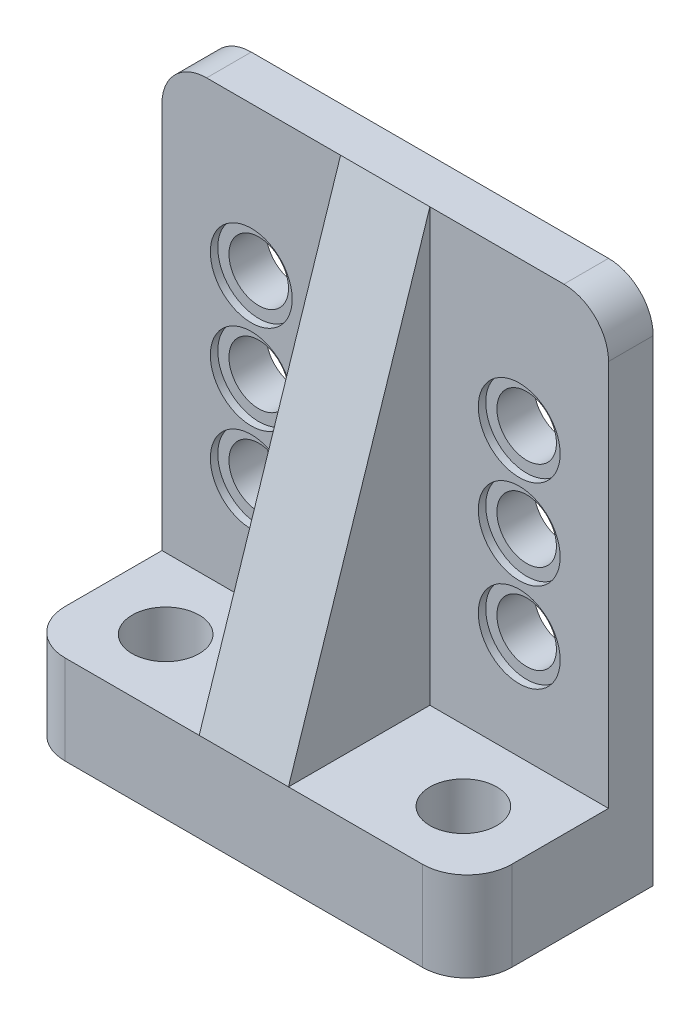
ISO-10303-21;
HEADER;
FILE_DESCRIPTION(('STEP AP214'),'2;1');
FILE_NAME('part.step','',(''),(''),'','','');
FILE_SCHEMA(('AUTOMOTIVE_DESIGN { 1 0 10303 214 1 1 1 1 }'));
ENDSEC;
DATA;
#1=APPLICATION_CONTEXT('core data for automotive mechanical design processes');
#2=APPLICATION_PROTOCOL_DEFINITION('international standard','automotive_design',2000,#1);
#3=PRODUCT_CONTEXT('',#1,'mechanical');
#4=PRODUCT('Part','Part','',(#3));
#5=PRODUCT_RELATED_PRODUCT_CATEGORY('part','',(#4));
#6=PRODUCT_DEFINITION_FORMATION('','',#4);
#7=PRODUCT_DEFINITION_CONTEXT('part definition',#1,'design');
#8=PRODUCT_DEFINITION('design','',#6,#7);
#9=PRODUCT_DEFINITION_SHAPE('','',#8);
#10=(LENGTH_UNIT() NAMED_UNIT(*) SI_UNIT(.MILLI.,.METRE.));
#11=(NAMED_UNIT(*) PLANE_ANGLE_UNIT() SI_UNIT($,.RADIAN.));
#12=(NAMED_UNIT(*) SI_UNIT($,.STERADIAN.) SOLID_ANGLE_UNIT());
#13=UNCERTAINTY_MEASURE_WITH_UNIT(LENGTH_MEASURE(1.E-05),#10,'distance_accuracy_value','');
#14=(GEOMETRIC_REPRESENTATION_CONTEXT(3) GLOBAL_UNCERTAINTY_ASSIGNED_CONTEXT((#13)) GLOBAL_UNIT_ASSIGNED_CONTEXT((#10,
#11,#12)) REPRESENTATION_CONTEXT('',''));
#15=CARTESIAN_POINT('',(0.,0.,0.));
#16=DIRECTION('',(0.,0.,1.));
#17=DIRECTION('',(1.,0.,0.));
#18=AXIS2_PLACEMENT_3D('',#15,#16,#17);
#19=CARTESIAN_POINT('',(5.99999999999999,25.,0.));
#20=DIRECTION('',(0.,0.,1.));
#21=DIRECTION('',(1.,0.,0.));
#22=AXIS2_PLACEMENT_3D('',#19,#20,#21);
#23=CYLINDRICAL_SURFACE('',#22,2.);
#24=CARTESIAN_POINT('',(5.99999999999999,25.,0.));
#25=DIRECTION('',(0.,0.,1.));
#26=DIRECTION('',(1.,0.,0.));
#27=AXIS2_PLACEMENT_3D('',#24,#25,#26);
#28=CIRCLE('',#27,2.);
#29=CARTESIAN_POINT('',(8.,25.,0.));
#30=VERTEX_POINT('',#29);
#31=EDGE_CURVE('E181',#30,#30,#28,.T.);
#32=ORIENTED_EDGE('',*,*,#31,.F.);
#33=EDGE_LOOP('',(#32));
#34=FACE_BOUND('',#33,.T.);
#35=CARTESIAN_POINT('',(5.99999999999999,25.,2.5));
#36=DIRECTION('',(0.,0.,1.));
#37=DIRECTION('',(1.,0.,0.));
#38=AXIS2_PLACEMENT_3D('',#35,#36,#37);
#39=CIRCLE('',#38,2.);
#40=CARTESIAN_POINT('',(8.,25.,2.5));
#41=VERTEX_POINT('',#40);
#42=EDGE_CURVE('E37',#41,#41,#39,.F.);
#43=ORIENTED_EDGE('',*,*,#42,.F.);
#44=EDGE_LOOP('',(#43));
#45=FACE_BOUND('',#44,.T.);
#46=ADVANCED_FACE('F33',(#34,#45),#23,.F.);
#47=CARTESIAN_POINT('',(24.,13.,0.));
#48=DIRECTION('',(0.,0.,1.));
#49=DIRECTION('',(1.,0.,0.));
#50=AXIS2_PLACEMENT_3D('',#47,#48,#49);
#51=CYLINDRICAL_SURFACE('',#50,2.);
#52=CARTESIAN_POINT('',(24.,13.,0.));
#53=DIRECTION('',(0.,0.,1.));
#54=DIRECTION('',(1.,0.,0.));
#55=AXIS2_PLACEMENT_3D('',#52,#53,#54);
#56=CIRCLE('',#55,2.);
#57=CARTESIAN_POINT('',(26.,13.,0.));
#58=VERTEX_POINT('',#57);
#59=EDGE_CURVE('E172',#58,#58,#56,.T.);
#60=ORIENTED_EDGE('',*,*,#59,.F.);
#61=EDGE_LOOP('',(#60));
#62=FACE_BOUND('',#61,.T.);
#63=CARTESIAN_POINT('',(24.,13.,2.5));
#64=DIRECTION('',(0.,0.,1.));
#65=DIRECTION('',(1.,0.,0.));
#66=AXIS2_PLACEMENT_3D('',#63,#64,#65);
#67=CIRCLE('',#66,2.);
#68=CARTESIAN_POINT('',(26.,13.,2.5));
#69=VERTEX_POINT('',#68);
#70=EDGE_CURVE('E260',#69,#69,#67,.F.);
#71=ORIENTED_EDGE('',*,*,#70,.F.);
#72=EDGE_LOOP('',(#71));
#73=FACE_BOUND('',#72,.T.);
#74=ADVANCED_FACE('F323',(#62,#73),#51,.F.);
#75=CARTESIAN_POINT('',(5.99999999999999,13.,0.));
#76=DIRECTION('',(0.,0.,1.));
#77=DIRECTION('',(1.,0.,0.));
#78=AXIS2_PLACEMENT_3D('',#75,#76,#77);
#79=CYLINDRICAL_SURFACE('',#78,2.);
#80=CARTESIAN_POINT('',(5.99999999999999,13.,0.));
#81=DIRECTION('',(0.,0.,1.));
#82=DIRECTION('',(-1.,0.,0.));
#83=AXIS2_PLACEMENT_3D('',#80,#81,#82);
#84=CIRCLE('',#83,2.);
#85=CARTESIAN_POINT('',(3.99999999999999,13.,0.));
#86=VERTEX_POINT('',#85);
#87=EDGE_CURVE('E169',#86,#86,#84,.T.);
#88=ORIENTED_EDGE('',*,*,#87,.F.);
#89=EDGE_LOOP('',(#88));
#90=FACE_BOUND('',#89,.T.);
#91=CARTESIAN_POINT('',(5.99999999999999,13.,2.5));
#92=DIRECTION('',(0.,0.,1.));
#93=DIRECTION('',(1.,0.,0.));
#94=AXIS2_PLACEMENT_3D('',#91,#92,#93);
#95=CIRCLE('',#94,2.);
#96=CARTESIAN_POINT('',(7.99999999999999,13.,2.5));
#97=VERTEX_POINT('',#96);
#98=EDGE_CURVE('E258',#97,#97,#95,.F.);
#99=ORIENTED_EDGE('',*,*,#98,.F.);
#100=EDGE_LOOP('',(#99));
#101=FACE_BOUND('',#100,.T.);
#102=ADVANCED_FACE('F329',(#90,#101),#79,.F.);
#103=CARTESIAN_POINT('',(5.99999999999999,19.,0.));
#104=DIRECTION('',(0.,0.,1.));
#105=DIRECTION('',(1.,0.,0.));
#106=AXIS2_PLACEMENT_3D('',#103,#104,#105);
#107=CYLINDRICAL_SURFACE('',#106,2.);
#108=CARTESIAN_POINT('',(5.99999999999999,19.,0.));
#109=DIRECTION('',(0.,0.,1.));
#110=DIRECTION('',(1.,0.,0.));
#111=AXIS2_PLACEMENT_3D('',#108,#109,#110);
#112=CIRCLE('',#111,2.);
#113=CARTESIAN_POINT('',(8.,19.,0.));
#114=VERTEX_POINT('',#113);
#115=EDGE_CURVE('E173',#114,#114,#112,.T.);
#116=ORIENTED_EDGE('',*,*,#115,.F.);
#117=EDGE_LOOP('',(#116));
#118=FACE_BOUND('',#117,.T.);
#119=CARTESIAN_POINT('',(5.99999999999999,19.,2.5));
#120=DIRECTION('',(0.,0.,1.));
#121=DIRECTION('',(1.,0.,0.));
#122=AXIS2_PLACEMENT_3D('',#119,#120,#121);
#123=CIRCLE('',#122,2.);
#124=CARTESIAN_POINT('',(8.,19.,2.5));
#125=VERTEX_POINT('',#124);
#126=EDGE_CURVE('E254',#125,#125,#123,.F.);
#127=ORIENTED_EDGE('',*,*,#126,.F.);
#128=EDGE_LOOP('',(#127));
#129=FACE_BOUND('',#128,.T.);
#130=ADVANCED_FACE('F526',(#118,#129),#107,.F.);
#131=CARTESIAN_POINT('',(24.,19.,0.));
#132=DIRECTION('',(0.,0.,1.));
#133=DIRECTION('',(1.,0.,0.));
#134=AXIS2_PLACEMENT_3D('',#131,#132,#133);
#135=CYLINDRICAL_SURFACE('',#134,2.);
#136=CARTESIAN_POINT('',(24.,19.,0.));
#137=DIRECTION('',(0.,0.,1.));
#138=DIRECTION('',(-1.,0.,0.));
#139=AXIS2_PLACEMENT_3D('',#136,#137,#138);
#140=CIRCLE('',#139,2.);
#141=CARTESIAN_POINT('',(22.,19.,0.));
#142=VERTEX_POINT('',#141);
#143=EDGE_CURVE('E168',#142,#142,#140,.T.);
#144=ORIENTED_EDGE('',*,*,#143,.F.);
#145=EDGE_LOOP('',(#144));
#146=FACE_BOUND('',#145,.T.);
#147=CARTESIAN_POINT('',(24.,19.,2.5));
#148=DIRECTION('',(0.,0.,1.));
#149=DIRECTION('',(1.,0.,0.));
#150=AXIS2_PLACEMENT_3D('',#147,#148,#149);
#151=CIRCLE('',#150,2.);
#152=CARTESIAN_POINT('',(26.,19.,2.5));
#153=VERTEX_POINT('',#152);
#154=EDGE_CURVE('E251',#153,#153,#151,.F.);
#155=ORIENTED_EDGE('',*,*,#154,.F.);
#156=EDGE_LOOP('',(#155));
#157=FACE_BOUND('',#156,.T.);
#158=ADVANCED_FACE('F535',(#146,#157),#135,.F.);
#159=CARTESIAN_POINT('',(24.,25.,0.));
#160=DIRECTION('',(0.,0.,1.));
#161=DIRECTION('',(1.,0.,0.));
#162=AXIS2_PLACEMENT_3D('',#159,#160,#161);
#163=CYLINDRICAL_SURFACE('',#162,2.);
#164=CARTESIAN_POINT('',(24.,25.,0.));
#165=DIRECTION('',(0.,0.,1.));
#166=DIRECTION('',(-1.,0.,0.));
#167=AXIS2_PLACEMENT_3D('',#164,#165,#166);
#168=CIRCLE('',#167,2.);
#169=CARTESIAN_POINT('',(22.,25.,0.));
#170=VERTEX_POINT('',#169);
#171=EDGE_CURVE('E178',#170,#170,#168,.T.);
#172=ORIENTED_EDGE('',*,*,#171,.F.);
#173=EDGE_LOOP('',(#172));
#174=FACE_BOUND('',#173,.T.);
#175=CARTESIAN_POINT('',(24.,25.,2.5));
#176=DIRECTION('',(0.,0.,1.));
#177=DIRECTION('',(1.,0.,0.));
#178=AXIS2_PLACEMENT_3D('',#175,#176,#177);
#179=CIRCLE('',#178,2.);
#180=CARTESIAN_POINT('',(26.,25.,2.5));
#181=VERTEX_POINT('',#180);
#182=EDGE_CURVE('E246',#181,#181,#179,.F.);
#183=ORIENTED_EDGE('',*,*,#182,.F.);
#184=EDGE_LOOP('',(#183));
#185=FACE_BOUND('',#184,.T.);
#186=ADVANCED_FACE('F545',(#174,#185),#163,.F.);
#187=CARTESIAN_POINT('',(0.,0.,3.));
#188=DIRECTION('',(0.,0.,-1.));
#189=DIRECTION('',(-1.,0.,0.));
#190=AXIS2_PLACEMENT_3D('',#187,#188,#189);
#191=PLANE('',#190);
#192=CARTESIAN_POINT('',(5.99999999999999,13.,3.));
#193=DIRECTION('',(0.,0.,1.));
#194=DIRECTION('',(1.,0.,0.));
#195=AXIS2_PLACEMENT_3D('',#192,#193,#194);
#196=CIRCLE('',#195,2.75);
#197=CARTESIAN_POINT('',(8.74999999999999,13.,3.));
#198=VERTEX_POINT('',#197);
#199=EDGE_CURVE('E700',#198,#198,#196,.T.);
#200=ORIENTED_EDGE('',*,*,#199,.F.);
#201=EDGE_LOOP('',(#200));
#202=FACE_BOUND('',#201,.T.);
#203=CARTESIAN_POINT('',(5.99999999999999,19.,3.));
#204=DIRECTION('',(0.,0.,1.));
#205=DIRECTION('',(1.,0.,0.));
#206=AXIS2_PLACEMENT_3D('',#203,#204,#205);
#207=CIRCLE('',#206,2.75);
#208=CARTESIAN_POINT('',(8.74999999999999,19.,3.));
#209=VERTEX_POINT('',#208);
#210=EDGE_CURVE('E692',#209,#209,#207,.T.);
#211=ORIENTED_EDGE('',*,*,#210,.F.);
#212=EDGE_LOOP('',(#211));
#213=FACE_BOUND('',#212,.T.);
#214=CARTESIAN_POINT('',(5.99999999999999,25.,3.));
#215=DIRECTION('',(0.,0.,1.));
#216=DIRECTION('',(1.,0.,0.));
#217=AXIS2_PLACEMENT_3D('',#214,#215,#216);
#218=CIRCLE('',#217,2.75);
#219=CARTESIAN_POINT('',(8.74999999999999,25.,3.));
#220=VERTEX_POINT('',#219);
#221=EDGE_CURVE('E690',#220,#220,#218,.T.);
#222=ORIENTED_EDGE('',*,*,#221,.F.);
#223=EDGE_LOOP('',(#222));
#224=FACE_BOUND('',#223,.T.);
#225=DIRECTION('',(-1.,0.,0.));
#226=VECTOR('',#225,1.);
#227=CARTESIAN_POINT('',(0.,35.,3.));
#228=LINE('',#227,#226);
#229=CARTESIAN_POINT('',(12.,35.,3.));
#230=VERTEX_POINT('',#229);
#231=CARTESIAN_POINT('',(3.,35.,3.));
#232=VERTEX_POINT('',#231);
#233=EDGE_CURVE('E192',#230,#232,#228,.T.);
#234=ORIENTED_EDGE('',*,*,#233,.T.);
#235=CARTESIAN_POINT('',(3.,32.,3.));
#236=DIRECTION('',(0.,0.,-1.));
#237=DIRECTION('',(-1.,0.,0.));
#238=AXIS2_PLACEMENT_3D('',#235,#236,#237);
#239=CIRCLE('',#238,3.);
#240=CARTESIAN_POINT('',(0.,32.,3.));
#241=VERTEX_POINT('',#240);
#242=EDGE_CURVE('E11',#232,#241,#239,.F.);
#243=ORIENTED_EDGE('',*,*,#242,.T.);
#244=DIRECTION('',(0.,-1.,0.));
#245=VECTOR('',#244,1.);
#246=CARTESIAN_POINT('',(0.,0.,3.));
#247=LINE('',#246,#245);
#248=CARTESIAN_POINT('',(0.,6.,3.));
#249=VERTEX_POINT('',#248);
#250=EDGE_CURVE('E187',#241,#249,#247,.T.);
#251=ORIENTED_EDGE('',*,*,#250,.T.);
#252=DIRECTION('',(-1.,0.,0.));
#253=VECTOR('',#252,1.);
#254=CARTESIAN_POINT('',(0.,6.,3.));
#255=LINE('',#254,#253);
#256=CARTESIAN_POINT('',(12.,6.,3.));
#257=VERTEX_POINT('',#256);
#258=EDGE_CURVE('E154',#257,#249,#255,.T.);
#259=ORIENTED_EDGE('',*,*,#258,.F.);
#260=DIRECTION('',(0.,1.,0.));
#261=VECTOR('',#260,1.);
#262=CARTESIAN_POINT('',(12.,35.,3.));
#263=LINE('',#262,#261);
#264=EDGE_CURVE('E280',#257,#230,#263,.T.);
#265=ORIENTED_EDGE('',*,*,#264,.T.);
#266=EDGE_LOOP('',(#234,#243,#251,#259,#265));
#267=FACE_BOUND('',#266,.T.);
#268=ADVANCED_FACE('F320',(#202,#213,#224,#267),#191,.F.);
#269=CARTESIAN_POINT('',(0.,6.,12.5));
#270=DIRECTION('',(0.,-1.,0.));
#271=DIRECTION('',(0.,0.,-1.));
#272=AXIS2_PLACEMENT_3D('',#269,#270,#271);
#273=PLANE('',#272);
#274=CARTESIAN_POINT('',(5.,6.,7.75));
#275=DIRECTION('',(0.,-1.,0.));
#276=DIRECTION('',(0.,0.,-1.));
#277=AXIS2_PLACEMENT_3D('',#274,#275,#276);
#278=CIRCLE('',#277,2.25);
#279=CARTESIAN_POINT('',(5.,6.,5.50000000000001));
#280=VERTEX_POINT('',#279);
#281=EDGE_CURVE('E211',#280,#280,#278,.T.);
#282=ORIENTED_EDGE('',*,*,#281,.T.);
#283=EDGE_LOOP('',(#282));
#284=FACE_BOUND('',#283,.T.);
#285=DIRECTION('',(0.,0.,-1.));
#286=VECTOR('',#285,1.);
#287=CARTESIAN_POINT('',(0.,6.,12.5));
#288=LINE('',#287,#286);
#289=CARTESIAN_POINT('',(0.,6.,9.5));
#290=VERTEX_POINT('',#289);
#291=EDGE_CURVE('E164',#290,#249,#288,.T.);
#292=ORIENTED_EDGE('',*,*,#291,.F.);
#293=CARTESIAN_POINT('',(3.,6.,9.5));
#294=DIRECTION('',(0.,-1.,0.));
#295=DIRECTION('',(0.,0.,-1.));
#296=AXIS2_PLACEMENT_3D('',#293,#294,#295);
#297=CIRCLE('',#296,3.);
#298=CARTESIAN_POINT('',(3.,6.,12.5));
#299=VERTEX_POINT('',#298);
#300=EDGE_CURVE('E229',#290,#299,#297,.F.);
#301=ORIENTED_EDGE('',*,*,#300,.T.);
#302=DIRECTION('',(-1.,0.,0.));
#303=VECTOR('',#302,1.);
#304=CARTESIAN_POINT('',(0.,6.,12.5));
#305=LINE('',#304,#303);
#306=CARTESIAN_POINT('',(12.,6.,12.5));
#307=VERTEX_POINT('',#306);
#308=EDGE_CURVE('E157',#307,#299,#305,.T.);
#309=ORIENTED_EDGE('',*,*,#308,.F.);
#310=DIRECTION('',(0.,0.,-1.));
#311=VECTOR('',#310,1.);
#312=CARTESIAN_POINT('',(12.,6.,3.));
#313=LINE('',#312,#311);
#314=EDGE_CURVE('E249',#307,#257,#313,.T.);
#315=ORIENTED_EDGE('',*,*,#314,.T.);
#316=ORIENTED_EDGE('',*,*,#258,.T.);
#317=EDGE_LOOP('',(#292,#301,#309,#315,#316));
#318=FACE_BOUND('',#317,.T.);
#319=ADVANCED_FACE('F308',(#284,#318),#273,.F.);
#320=CARTESIAN_POINT('',(24.,19.,3.));
#321=DIRECTION('',(0.,0.,1.));
#322=DIRECTION('',(1.,0.,0.));
#323=AXIS2_PLACEMENT_3D('',#320,#321,#322);
#324=CIRCLE('',#323,2.75);
#325=CARTESIAN_POINT('',(26.75,19.,3.));
#326=VERTEX_POINT('',#325);
#327=EDGE_CURVE('E712',#326,#326,#324,.T.);
#328=ORIENTED_EDGE('',*,*,#327,.F.);
#329=EDGE_LOOP('',(#328));
#330=FACE_BOUND('',#329,.T.);
#331=CARTESIAN_POINT('',(24.,13.,3.));
#332=DIRECTION('',(0.,0.,1.));
#333=DIRECTION('',(1.,0.,0.));
#334=AXIS2_PLACEMENT_3D('',#331,#332,#333);
#335=CIRCLE('',#334,2.75);
#336=CARTESIAN_POINT('',(26.75,13.,3.));
#337=VERTEX_POINT('',#336);
#338=EDGE_CURVE('E706',#337,#337,#335,.T.);
#339=ORIENTED_EDGE('',*,*,#338,.F.);
#340=EDGE_LOOP('',(#339));
#341=FACE_BOUND('',#340,.T.);
#342=CARTESIAN_POINT('',(24.,25.,3.));
#343=DIRECTION('',(0.,0.,1.));
#344=DIRECTION('',(1.,0.,0.));
#345=AXIS2_PLACEMENT_3D('',#342,#343,#344);
#346=CIRCLE('',#345,2.75);
#347=CARTESIAN_POINT('',(26.75,25.,3.));
#348=VERTEX_POINT('',#347);
#349=EDGE_CURVE('E265',#348,#348,#346,.T.);
#350=ORIENTED_EDGE('',*,*,#349,.F.);
#351=EDGE_LOOP('',(#350));
#352=FACE_BOUND('',#351,.T.);
#353=DIRECTION('',(0.,1.,0.));
#354=VECTOR('',#353,1.);
#355=CARTESIAN_POINT('',(30.,0.,3.));
#356=LINE('',#355,#354);
#357=CARTESIAN_POINT('',(30.,6.,3.));
#358=VERTEX_POINT('',#357);
#359=CARTESIAN_POINT('',(30.,32.,3.));
#360=VERTEX_POINT('',#359);
#361=EDGE_CURVE('E189',#358,#360,#356,.T.);
#362=ORIENTED_EDGE('',*,*,#361,.T.);
#363=CARTESIAN_POINT('',(27.,32.,3.));
#364=DIRECTION('',(0.,0.,-1.));
#365=DIRECTION('',(-1.,0.,0.));
#366=AXIS2_PLACEMENT_3D('',#363,#364,#365);
#367=CIRCLE('',#366,3.);
#368=CARTESIAN_POINT('',(27.,35.,3.));
#369=VERTEX_POINT('',#368);
#370=EDGE_CURVE('E42',#360,#369,#367,.F.);
#371=ORIENTED_EDGE('',*,*,#370,.T.);
#372=CARTESIAN_POINT('',(18.,35.,3.));
#373=VERTEX_POINT('',#372);
#374=EDGE_CURVE('E148',#369,#373,#228,.T.);
#375=ORIENTED_EDGE('',*,*,#374,.T.);
#376=DIRECTION('',(0.,1.,0.));
#377=VECTOR('',#376,1.);
#378=CARTESIAN_POINT('',(18.,35.,3.));
#379=LINE('',#378,#377);
#380=CARTESIAN_POINT('',(18.,6.,3.));
#381=VERTEX_POINT('',#380);
#382=EDGE_CURVE('E135',#381,#373,#379,.T.);
#383=ORIENTED_EDGE('',*,*,#382,.F.);
#384=EDGE_CURVE('E146',#358,#381,#255,.T.);
#385=ORIENTED_EDGE('',*,*,#384,.F.);
#386=EDGE_LOOP('',(#362,#371,#375,#383,#385));
#387=FACE_BOUND('',#386,.T.);
#388=ADVANCED_FACE('F145',(#330,#341,#352,#387),#191,.F.);
#389=CARTESIAN_POINT('',(0.,0.,3.));
#390=DIRECTION('',(1.,0.,0.));
#391=DIRECTION('',(0.,0.,-1.));
#392=AXIS2_PLACEMENT_3D('',#389,#390,#391);
#393=PLANE('',#392);
#394=DIRECTION('',(0.,0.,-1.));
#395=VECTOR('',#394,1.);
#396=CARTESIAN_POINT('',(0.,0.,3.));
#397=LINE('',#396,#395);
#398=CARTESIAN_POINT('',(0.,0.,9.5));
#399=VERTEX_POINT('',#398);
#400=CARTESIAN_POINT('',(0.,0.,0.));
#401=VERTEX_POINT('',#400);
#402=EDGE_CURVE('E204',#399,#401,#397,.T.);
#403=ORIENTED_EDGE('',*,*,#402,.F.);
#404=DIRECTION('',(0.,-1.,0.));
#405=VECTOR('',#404,1.);
#406=CARTESIAN_POINT('',(0.,0.,9.5));
#407=LINE('',#406,#405);
#408=EDGE_CURVE('E227',#399,#290,#407,.F.);
#409=ORIENTED_EDGE('',*,*,#408,.T.);
#410=ORIENTED_EDGE('',*,*,#291,.T.);
#411=ORIENTED_EDGE('',*,*,#250,.F.);
#412=DIRECTION('',(0.,0.,-1.));
#413=VECTOR('',#412,1.);
#414=CARTESIAN_POINT('',(0.,32.,3.));
#415=LINE('',#414,#413);
#416=CARTESIAN_POINT('',(0.,32.,0.));
#417=VERTEX_POINT('',#416);
#418=EDGE_CURVE('E224',#241,#417,#415,.T.);
#419=ORIENTED_EDGE('',*,*,#418,.T.);
#420=DIRECTION('',(0.,-1.,0.));
#421=VECTOR('',#420,1.);
#422=CARTESIAN_POINT('',(0.,0.,0.));
#423=LINE('',#422,#421);
#424=EDGE_CURVE('E186',#417,#401,#423,.T.);
#425=ORIENTED_EDGE('',*,*,#424,.T.);
#426=EDGE_LOOP('',(#403,#409,#410,#411,#419,#425));
#427=FACE_BOUND('',#426,.T.);
#428=ADVANCED_FACE('F337',(#427),#393,.F.);
#429=CARTESIAN_POINT('',(0.,0.,3.));
#430=DIRECTION('',(0.,1.,0.));
#431=DIRECTION('',(0.,0.,1.));
#432=AXIS2_PLACEMENT_3D('',#429,#430,#431);
#433=PLANE('',#432);
#434=CARTESIAN_POINT('',(5.,0.,7.75));
#435=DIRECTION('',(0.,1.,0.));
#436=DIRECTION('',(0.,0.,-1.));
#437=AXIS2_PLACEMENT_3D('',#434,#435,#436);
#438=CIRCLE('',#437,2.25);
#439=CARTESIAN_POINT('',(5.,0.,5.50000000000001));
#440=VERTEX_POINT('',#439);
#441=EDGE_CURVE('E214',#440,#440,#438,.T.);
#442=ORIENTED_EDGE('',*,*,#441,.T.);
#443=EDGE_LOOP('',(#442));
#444=FACE_BOUND('',#443,.T.);
#445=CARTESIAN_POINT('',(25.,0.,7.75));
#446=DIRECTION('',(0.,1.,0.));
#447=DIRECTION('',(0.,0.,1.));
#448=AXIS2_PLACEMENT_3D('',#445,#446,#447);
#449=CIRCLE('',#448,2.25);
#450=CARTESIAN_POINT('',(25.,0.,10.));
#451=VERTEX_POINT('',#450);
#452=EDGE_CURVE('E210',#451,#451,#449,.T.);
#453=ORIENTED_EDGE('',*,*,#452,.T.);
#454=EDGE_LOOP('',(#453));
#455=FACE_BOUND('',#454,.T.);
#456=DIRECTION('',(1.,0.,0.));
#457=VECTOR('',#456,1.);
#458=CARTESIAN_POINT('',(0.,0.,12.5));
#459=LINE('',#458,#457);
#460=CARTESIAN_POINT('',(3.,0.,12.5));
#461=VERTEX_POINT('',#460);
#462=CARTESIAN_POINT('',(27.,0.,12.5));
#463=VERTEX_POINT('',#462);
#464=EDGE_CURVE('E153',#461,#463,#459,.T.);
#465=ORIENTED_EDGE('',*,*,#464,.F.);
#466=CARTESIAN_POINT('',(3.,0.,9.5));
#467=DIRECTION('',(0.,1.,0.));
#468=DIRECTION('',(0.,0.,1.));
#469=AXIS2_PLACEMENT_3D('',#466,#467,#468);
#470=CIRCLE('',#469,3.);
#471=EDGE_CURVE('E222',#461,#399,#470,.F.);
#472=ORIENTED_EDGE('',*,*,#471,.T.);
#473=ORIENTED_EDGE('',*,*,#402,.T.);
#474=DIRECTION('',(1.,0.,0.));
#475=VECTOR('',#474,1.);
#476=CARTESIAN_POINT('',(0.,0.,0.));
#477=LINE('',#476,#475);
#478=CARTESIAN_POINT('',(30.,0.,0.));
#479=VERTEX_POINT('',#478);
#480=EDGE_CURVE('E196',#401,#479,#477,.T.);
#481=ORIENTED_EDGE('',*,*,#480,.T.);
#482=DIRECTION('',(0.,0.,-1.));
#483=VECTOR('',#482,1.);
#484=CARTESIAN_POINT('',(30.,0.,3.));
#485=LINE('',#484,#483);
#486=CARTESIAN_POINT('',(30.,0.,9.5));
#487=VERTEX_POINT('',#486);
#488=EDGE_CURVE('E194',#487,#479,#485,.T.);
#489=ORIENTED_EDGE('',*,*,#488,.F.);
#490=CARTESIAN_POINT('',(27.,0.,9.5));
#491=DIRECTION('',(0.,1.,0.));
#492=DIRECTION('',(0.,0.,1.));
#493=AXIS2_PLACEMENT_3D('',#490,#491,#492);
#494=CIRCLE('',#493,3.);
#495=EDGE_CURVE('E220',#487,#463,#494,.F.);
#496=ORIENTED_EDGE('',*,*,#495,.T.);
#497=EDGE_LOOP('',(#465,#472,#473,#481,#489,#496));
#498=FACE_BOUND('',#497,.T.);
#499=ADVANCED_FACE('F294',(#444,#455,#498),#433,.F.);
#500=CARTESIAN_POINT('',(30.,0.,3.));
#501=DIRECTION('',(-1.,0.,0.));
#502=DIRECTION('',(0.,0.,1.));
#503=AXIS2_PLACEMENT_3D('',#500,#501,#502);
#504=PLANE('',#503);
#505=DIRECTION('',(0.,0.,-1.));
#506=VECTOR('',#505,1.);
#507=CARTESIAN_POINT('',(30.,6.,12.5));
#508=LINE('',#507,#506);
#509=CARTESIAN_POINT('',(30.,6.,9.5));
#510=VERTEX_POINT('',#509);
#511=EDGE_CURVE('E152',#510,#358,#508,.T.);
#512=ORIENTED_EDGE('',*,*,#511,.F.);
#513=DIRECTION('',(0.,1.,0.));
#514=VECTOR('',#513,1.);
#515=CARTESIAN_POINT('',(30.,0.,9.5));
#516=LINE('',#515,#514);
#517=EDGE_CURVE('E235',#510,#487,#516,.F.);
#518=ORIENTED_EDGE('',*,*,#517,.T.);
#519=ORIENTED_EDGE('',*,*,#488,.T.);
#520=DIRECTION('',(0.,1.,0.));
#521=VECTOR('',#520,1.);
#522=CARTESIAN_POINT('',(30.,0.,0.));
#523=LINE('',#522,#521);
#524=CARTESIAN_POINT('',(30.,32.,0.));
#525=VERTEX_POINT('',#524);
#526=EDGE_CURVE('E199',#479,#525,#523,.T.);
#527=ORIENTED_EDGE('',*,*,#526,.T.);
#528=DIRECTION('',(0.,0.,-1.));
#529=VECTOR('',#528,1.);
#530=CARTESIAN_POINT('',(30.,32.,3.));
#531=LINE('',#530,#529);
#532=EDGE_CURVE('E233',#525,#360,#531,.F.);
#533=ORIENTED_EDGE('',*,*,#532,.T.);
#534=ORIENTED_EDGE('',*,*,#361,.F.);
#535=EDGE_LOOP('',(#512,#518,#519,#527,#533,#534));
#536=FACE_BOUND('',#535,.T.);
#537=ADVANCED_FACE('F342',(#536),#504,.F.);
#538=CARTESIAN_POINT('',(0.,35.,3.));
#539=DIRECTION('',(0.,-1.,0.));
#540=DIRECTION('',(0.,0.,-1.));
#541=AXIS2_PLACEMENT_3D('',#538,#539,#540);
#542=PLANE('',#541);
#543=ORIENTED_EDGE('',*,*,#374,.F.);
#544=DIRECTION('',(0.,0.,-1.));
#545=VECTOR('',#544,1.);
#546=CARTESIAN_POINT('',(27.,35.,3.));
#547=LINE('',#546,#545);
#548=CARTESIAN_POINT('',(27.,35.,0.));
#549=VERTEX_POINT('',#548);
#550=EDGE_CURVE('E238',#369,#549,#547,.T.);
#551=ORIENTED_EDGE('',*,*,#550,.T.);
#552=DIRECTION('',(-1.,0.,0.));
#553=VECTOR('',#552,1.);
#554=CARTESIAN_POINT('',(0.,35.,0.));
#555=LINE('',#554,#553);
#556=CARTESIAN_POINT('',(3.,35.,0.));
#557=VERTEX_POINT('',#556);
#558=EDGE_CURVE('E190',#549,#557,#555,.T.);
#559=ORIENTED_EDGE('',*,*,#558,.T.);
#560=DIRECTION('',(0.,0.,-1.));
#561=VECTOR('',#560,1.);
#562=CARTESIAN_POINT('',(3.,35.,3.));
#563=LINE('',#562,#561);
#564=EDGE_CURVE('E57',#557,#232,#563,.F.);
#565=ORIENTED_EDGE('',*,*,#564,.T.);
#566=ORIENTED_EDGE('',*,*,#233,.F.);
#567=DIRECTION('',(-1.,0.,0.));
#568=VECTOR('',#567,1.);
#569=CARTESIAN_POINT('',(18.,35.,3.));
#570=LINE('',#569,#568);
#571=EDGE_CURVE('E287',#373,#230,#570,.T.);
#572=ORIENTED_EDGE('',*,*,#571,.F.);
#573=EDGE_LOOP('',(#543,#551,#559,#565,#566,#572));
#574=FACE_BOUND('',#573,.T.);
#575=ADVANCED_FACE('F315',(#574),#542,.F.);
#576=CARTESIAN_POINT('',(0.,0.,0.));
#577=DIRECTION('',(0.,0.,-1.));
#578=DIRECTION('',(-1.,0.,0.));
#579=AXIS2_PLACEMENT_3D('',#576,#577,#578);
#580=PLANE('',#579);
#581=ORIENTED_EDGE('',*,*,#143,.T.);
#582=EDGE_LOOP('',(#581));
#583=FACE_BOUND('',#582,.T.);
#584=ORIENTED_EDGE('',*,*,#115,.T.);
#585=EDGE_LOOP('',(#584));
#586=FACE_BOUND('',#585,.T.);
#587=ORIENTED_EDGE('',*,*,#87,.T.);
#588=EDGE_LOOP('',(#587));
#589=FACE_BOUND('',#588,.T.);
#590=ORIENTED_EDGE('',*,*,#59,.T.);
#591=EDGE_LOOP('',(#590));
#592=FACE_BOUND('',#591,.T.);
#593=ORIENTED_EDGE('',*,*,#171,.T.);
#594=EDGE_LOOP('',(#593));
#595=FACE_BOUND('',#594,.T.);
#596=ORIENTED_EDGE('',*,*,#31,.T.);
#597=EDGE_LOOP('',(#596));
#598=FACE_BOUND('',#597,.T.);
#599=ORIENTED_EDGE('',*,*,#558,.F.);
#600=CARTESIAN_POINT('',(27.,32.,0.));
#601=DIRECTION('',(0.,0.,-1.));
#602=DIRECTION('',(-1.,0.,0.));
#603=AXIS2_PLACEMENT_3D('',#600,#601,#602);
#604=CIRCLE('',#603,3.);
#605=EDGE_CURVE('E243',#549,#525,#604,.T.);
#606=ORIENTED_EDGE('',*,*,#605,.T.);
#607=ORIENTED_EDGE('',*,*,#526,.F.);
#608=ORIENTED_EDGE('',*,*,#480,.F.);
#609=ORIENTED_EDGE('',*,*,#424,.F.);
#610=CARTESIAN_POINT('',(3.,32.,0.));
#611=DIRECTION('',(0.,0.,-1.));
#612=DIRECTION('',(-1.,0.,0.));
#613=AXIS2_PLACEMENT_3D('',#610,#611,#612);
#614=CIRCLE('',#613,3.);
#615=EDGE_CURVE('E241',#417,#557,#614,.T.);
#616=ORIENTED_EDGE('',*,*,#615,.T.);
#617=EDGE_LOOP('',(#599,#606,#607,#608,#609,#616));
#618=FACE_BOUND('',#617,.T.);
#619=ADVANCED_FACE('F306',(#583,#586,#589,#592,#595,#598,#618),#580,.T.);
#620=CARTESIAN_POINT('',(25.,6.,7.75));
#621=DIRECTION('',(0.,-1.,0.));
#622=DIRECTION('',(0.,0.,-1.));
#623=AXIS2_PLACEMENT_3D('',#620,#621,#622);
#624=CIRCLE('',#623,2.25);
#625=CARTESIAN_POINT('',(25.,6.,5.5));
#626=VERTEX_POINT('',#625);
#627=EDGE_CURVE('E160',#626,#626,#624,.T.);
#628=ORIENTED_EDGE('',*,*,#627,.T.);
#629=EDGE_LOOP('',(#628));
#630=FACE_BOUND('',#629,.T.);
#631=CARTESIAN_POINT('',(27.,6.,12.5));
#632=VERTEX_POINT('',#631);
#633=CARTESIAN_POINT('',(18.,6.,12.5));
#634=VERTEX_POINT('',#633);
#635=EDGE_CURVE('E163',#632,#634,#305,.T.);
#636=ORIENTED_EDGE('',*,*,#635,.F.);
#637=CARTESIAN_POINT('',(27.,6.,9.5));
#638=DIRECTION('',(0.,-1.,0.));
#639=DIRECTION('',(0.,0.,-1.));
#640=AXIS2_PLACEMENT_3D('',#637,#638,#639);
#641=CIRCLE('',#640,3.);
#642=EDGE_CURVE('E231',#632,#510,#641,.F.);
#643=ORIENTED_EDGE('',*,*,#642,.T.);
#644=ORIENTED_EDGE('',*,*,#511,.T.);
#645=ORIENTED_EDGE('',*,*,#384,.T.);
#646=DIRECTION('',(0.,0.,-1.));
#647=VECTOR('',#646,1.);
#648=CARTESIAN_POINT('',(18.,6.,3.));
#649=LINE('',#648,#647);
#650=EDGE_CURVE('E132',#634,#381,#649,.T.);
#651=ORIENTED_EDGE('',*,*,#650,.F.);
#652=EDGE_LOOP('',(#636,#643,#644,#645,#651));
#653=FACE_BOUND('',#652,.T.);
#654=ADVANCED_FACE('F150',(#630,#653),#273,.F.);
#655=CARTESIAN_POINT('',(0.,0.,12.5));
#656=DIRECTION('',(0.,0.,-1.));
#657=DIRECTION('',(-1.,0.,0.));
#658=AXIS2_PLACEMENT_3D('',#655,#656,#657);
#659=PLANE('',#658);
#660=ORIENTED_EDGE('',*,*,#308,.T.);
#661=DIRECTION('',(0.,-1.,0.));
#662=VECTOR('',#661,1.);
#663=CARTESIAN_POINT('',(3.,0.,12.5));
#664=LINE('',#663,#662);
#665=EDGE_CURVE('E217',#299,#461,#664,.T.);
#666=ORIENTED_EDGE('',*,*,#665,.T.);
#667=ORIENTED_EDGE('',*,*,#464,.T.);
#668=DIRECTION('',(0.,1.,0.));
#669=VECTOR('',#668,1.);
#670=CARTESIAN_POINT('',(27.,0.,12.5));
#671=LINE('',#670,#669);
#672=EDGE_CURVE('E207',#463,#632,#671,.T.);
#673=ORIENTED_EDGE('',*,*,#672,.T.);
#674=ORIENTED_EDGE('',*,*,#635,.T.);
#675=DIRECTION('',(-1.,0.,0.));
#676=VECTOR('',#675,1.);
#677=CARTESIAN_POINT('',(18.,6.,12.5));
#678=LINE('',#677,#676);
#679=EDGE_CURVE('E277',#634,#307,#678,.T.);
#680=ORIENTED_EDGE('',*,*,#679,.T.);
#681=EDGE_LOOP('',(#660,#666,#667,#673,#674,#680));
#682=FACE_BOUND('',#681,.T.);
#683=ADVANCED_FACE('F301',(#682),#659,.F.);
#684=CARTESIAN_POINT('',(25.,0.,7.75));
#685=DIRECTION('',(0.,1.,0.));
#686=DIRECTION('',(0.,0.,1.));
#687=AXIS2_PLACEMENT_3D('',#684,#685,#686);
#688=CYLINDRICAL_SURFACE('',#687,2.25);
#689=ORIENTED_EDGE('',*,*,#452,.F.);
#690=EDGE_LOOP('',(#689));
#691=FACE_BOUND('',#690,.T.);
#692=ORIENTED_EDGE('',*,*,#627,.F.);
#693=EDGE_LOOP('',(#692));
#694=FACE_BOUND('',#693,.T.);
#695=ADVANCED_FACE('F297',(#691,#694),#688,.F.);
#696=CARTESIAN_POINT('',(5.,0.,7.75));
#697=DIRECTION('',(0.,1.,0.));
#698=DIRECTION('',(0.,0.,1.));
#699=AXIS2_PLACEMENT_3D('',#696,#697,#698);
#700=CYLINDRICAL_SURFACE('',#699,2.25);
#701=ORIENTED_EDGE('',*,*,#441,.F.);
#702=EDGE_LOOP('',(#701));
#703=FACE_BOUND('',#702,.T.);
#704=ORIENTED_EDGE('',*,*,#281,.F.);
#705=EDGE_LOOP('',(#704));
#706=FACE_BOUND('',#705,.T.);
#707=ADVANCED_FACE('F300',(#703,#706),#700,.F.);
#708=CARTESIAN_POINT('',(18.,6.,12.5));
#709=DIRECTION('',(0.,-0.311308129797235,-0.950309027802087));
#710=DIRECTION('',(0.,0.950309027802087,-0.311308129797235));
#711=AXIS2_PLACEMENT_3D('',#708,#709,#710);
#712=PLANE('',#711);
#713=DIRECTION('',(0.,-0.950309027802087,0.311308129797235));
#714=VECTOR('',#713,1.);
#715=CARTESIAN_POINT('',(12.,6.,12.5));
#716=LINE('',#715,#714);
#717=EDGE_CURVE('E142',#230,#307,#716,.T.);
#718=ORIENTED_EDGE('',*,*,#717,.T.);
#719=ORIENTED_EDGE('',*,*,#679,.F.);
#720=DIRECTION('',(0.,-0.950309027802087,0.311308129797235));
#721=VECTOR('',#720,1.);
#722=CARTESIAN_POINT('',(18.,6.,12.5));
#723=LINE('',#722,#721);
#724=EDGE_CURVE('E137',#373,#634,#723,.T.);
#725=ORIENTED_EDGE('',*,*,#724,.F.);
#726=ORIENTED_EDGE('',*,*,#571,.T.);
#727=EDGE_LOOP('',(#718,#719,#725,#726));
#728=FACE_BOUND('',#727,.T.);
#729=ADVANCED_FACE('F385',(#728),#712,.F.);
#730=CARTESIAN_POINT('',(18.,0.,0.));
#731=DIRECTION('',(1.,0.,0.));
#732=DIRECTION('',(0.,0.,-1.));
#733=AXIS2_PLACEMENT_3D('',#730,#731,#732);
#734=PLANE('',#733);
#735=ORIENTED_EDGE('',*,*,#650,.T.);
#736=ORIENTED_EDGE('',*,*,#382,.T.);
#737=ORIENTED_EDGE('',*,*,#724,.T.);
#738=EDGE_LOOP('',(#735,#736,#737));
#739=FACE_BOUND('',#738,.T.);
#740=ADVANCED_FACE('F134',(#739),#734,.T.);
#741=CARTESIAN_POINT('',(12.,0.,0.));
#742=DIRECTION('',(1.,0.,0.));
#743=DIRECTION('',(0.,0.,-1.));
#744=AXIS2_PLACEMENT_3D('',#741,#742,#743);
#745=PLANE('',#744);
#746=ORIENTED_EDGE('',*,*,#314,.F.);
#747=ORIENTED_EDGE('',*,*,#717,.F.);
#748=ORIENTED_EDGE('',*,*,#264,.F.);
#749=EDGE_LOOP('',(#746,#747,#748));
#750=FACE_BOUND('',#749,.T.);
#751=ADVANCED_FACE('F356',(#750),#745,.F.);
#752=CARTESIAN_POINT('',(3.,0.,9.5));
#753=DIRECTION('',(0.,-1.,0.));
#754=DIRECTION('',(0.,0.,-1.));
#755=AXIS2_PLACEMENT_3D('',#752,#753,#754);
#756=CYLINDRICAL_SURFACE('',#755,3.);
#757=ORIENTED_EDGE('',*,*,#300,.F.);
#758=ORIENTED_EDGE('',*,*,#408,.F.);
#759=ORIENTED_EDGE('',*,*,#471,.F.);
#760=ORIENTED_EDGE('',*,*,#665,.F.);
#761=EDGE_LOOP('',(#757,#758,#759,#760));
#762=FACE_BOUND('',#761,.T.);
#763=ADVANCED_FACE('F352',(#762),#756,.T.);
#764=CARTESIAN_POINT('',(27.,0.,9.5));
#765=DIRECTION('',(0.,1.,0.));
#766=DIRECTION('',(0.,0.,1.));
#767=AXIS2_PLACEMENT_3D('',#764,#765,#766);
#768=CYLINDRICAL_SURFACE('',#767,3.);
#769=ORIENTED_EDGE('',*,*,#495,.F.);
#770=ORIENTED_EDGE('',*,*,#517,.F.);
#771=ORIENTED_EDGE('',*,*,#642,.F.);
#772=ORIENTED_EDGE('',*,*,#672,.F.);
#773=EDGE_LOOP('',(#769,#770,#771,#772));
#774=FACE_BOUND('',#773,.T.);
#775=ADVANCED_FACE('F355',(#774),#768,.T.);
#776=CARTESIAN_POINT('',(27.,32.,3.));
#777=DIRECTION('',(0.,0.,-1.));
#778=DIRECTION('',(-1.,0.,0.));
#779=AXIS2_PLACEMENT_3D('',#776,#777,#778);
#780=CYLINDRICAL_SURFACE('',#779,3.);
#781=ORIENTED_EDGE('',*,*,#370,.F.);
#782=ORIENTED_EDGE('',*,*,#532,.F.);
#783=ORIENTED_EDGE('',*,*,#605,.F.);
#784=ORIENTED_EDGE('',*,*,#550,.F.);
#785=EDGE_LOOP('',(#781,#782,#783,#784));
#786=FACE_BOUND('',#785,.T.);
#787=ADVANCED_FACE('F359',(#786),#780,.T.);
#788=CARTESIAN_POINT('',(3.,32.,3.));
#789=DIRECTION('',(0.,0.,-1.));
#790=DIRECTION('',(-1.,0.,0.));
#791=AXIS2_PLACEMENT_3D('',#788,#789,#790);
#792=CYLINDRICAL_SURFACE('',#791,3.);
#793=ORIENTED_EDGE('',*,*,#242,.F.);
#794=ORIENTED_EDGE('',*,*,#564,.F.);
#795=ORIENTED_EDGE('',*,*,#615,.F.);
#796=ORIENTED_EDGE('',*,*,#418,.F.);
#797=EDGE_LOOP('',(#793,#794,#795,#796));
#798=FACE_BOUND('',#797,.T.);
#799=ADVANCED_FACE('F35',(#798),#792,.T.);
#800=CARTESIAN_POINT('',(24.,25.,2.5));
#801=DIRECTION('',(0.,0.,1.));
#802=DIRECTION('',(1.,0.,0.));
#803=AXIS2_PLACEMENT_3D('',#800,#801,#802);
#804=PLANE('',#803);
#805=CARTESIAN_POINT('',(24.,25.,2.5));
#806=DIRECTION('',(0.,0.,1.));
#807=DIRECTION('',(1.,0.,0.));
#808=AXIS2_PLACEMENT_3D('',#805,#806,#807);
#809=CIRCLE('',#808,2.75);
#810=CARTESIAN_POINT('',(26.75,25.,2.5));
#811=VERTEX_POINT('',#810);
#812=EDGE_CURVE('E250',#811,#811,#809,.T.);
#813=ORIENTED_EDGE('',*,*,#812,.T.);
#814=EDGE_LOOP('',(#813));
#815=FACE_BOUND('',#814,.T.);
#816=ORIENTED_EDGE('',*,*,#182,.T.);
#817=EDGE_LOOP('',(#816));
#818=FACE_BOUND('',#817,.T.);
#819=ADVANCED_FACE('F366',(#815,#818),#804,.T.);
#820=CARTESIAN_POINT('',(24.,25.,2.5));
#821=DIRECTION('',(0.,0.,1.));
#822=DIRECTION('',(1.,0.,0.));
#823=AXIS2_PLACEMENT_3D('',#820,#821,#822);
#824=CYLINDRICAL_SURFACE('',#823,2.75);
#825=ORIENTED_EDGE('',*,*,#812,.F.);
#826=EDGE_LOOP('',(#825));
#827=FACE_BOUND('',#826,.T.);
#828=ORIENTED_EDGE('',*,*,#349,.T.);
#829=EDGE_LOOP('',(#828));
#830=FACE_BOUND('',#829,.T.);
#831=ADVANCED_FACE('F571',(#827,#830),#824,.F.);
#832=CARTESIAN_POINT('',(24.,19.,2.5));
#833=DIRECTION('',(0.,0.,1.));
#834=DIRECTION('',(1.,0.,0.));
#835=AXIS2_PLACEMENT_3D('',#832,#833,#834);
#836=PLANE('',#835);
#837=CARTESIAN_POINT('',(24.,19.,2.5));
#838=DIRECTION('',(0.,0.,1.));
#839=DIRECTION('',(1.,0.,0.));
#840=AXIS2_PLACEMENT_3D('',#837,#838,#839);
#841=CIRCLE('',#840,2.75);
#842=CARTESIAN_POINT('',(26.75,19.,2.5));
#843=VERTEX_POINT('',#842);
#844=EDGE_CURVE('E255',#843,#843,#841,.T.);
#845=ORIENTED_EDGE('',*,*,#844,.T.);
#846=EDGE_LOOP('',(#845));
#847=FACE_BOUND('',#846,.T.);
#848=ORIENTED_EDGE('',*,*,#154,.T.);
#849=EDGE_LOOP('',(#848));
#850=FACE_BOUND('',#849,.T.);
#851=ADVANCED_FACE('F581',(#847,#850),#836,.T.);
#852=CARTESIAN_POINT('',(24.,19.,2.5));
#853=DIRECTION('',(0.,0.,1.));
#854=DIRECTION('',(1.,0.,0.));
#855=AXIS2_PLACEMENT_3D('',#852,#853,#854);
#856=CYLINDRICAL_SURFACE('',#855,2.75);
#857=ORIENTED_EDGE('',*,*,#844,.F.);
#858=EDGE_LOOP('',(#857));
#859=FACE_BOUND('',#858,.T.);
#860=ORIENTED_EDGE('',*,*,#327,.T.);
#861=EDGE_LOOP('',(#860));
#862=FACE_BOUND('',#861,.T.);
#863=ADVANCED_FACE('F590',(#859,#862),#856,.F.);
#864=CARTESIAN_POINT('',(5.99999999999999,19.,2.5));
#865=DIRECTION('',(0.,0.,1.));
#866=DIRECTION('',(1.,0.,0.));
#867=AXIS2_PLACEMENT_3D('',#864,#865,#866);
#868=PLANE('',#867);
#869=CARTESIAN_POINT('',(5.99999999999999,19.,2.5));
#870=DIRECTION('',(0.,0.,1.));
#871=DIRECTION('',(1.,0.,0.));
#872=AXIS2_PLACEMENT_3D('',#869,#870,#871);
#873=CIRCLE('',#872,2.75);
#874=CARTESIAN_POINT('',(8.74999999999999,19.,2.5));
#875=VERTEX_POINT('',#874);
#876=EDGE_CURVE('E697',#875,#875,#873,.T.);
#877=ORIENTED_EDGE('',*,*,#876,.T.);
#878=EDGE_LOOP('',(#877));
#879=FACE_BOUND('',#878,.T.);
#880=ORIENTED_EDGE('',*,*,#126,.T.);
#881=EDGE_LOOP('',(#880));
#882=FACE_BOUND('',#881,.T.);
#883=ADVANCED_FACE('F600',(#879,#882),#868,.T.);
#884=CARTESIAN_POINT('',(5.99999999999999,19.,2.5));
#885=DIRECTION('',(0.,0.,1.));
#886=DIRECTION('',(1.,0.,0.));
#887=AXIS2_PLACEMENT_3D('',#884,#885,#886);
#888=CYLINDRICAL_SURFACE('',#887,2.75);
#889=ORIENTED_EDGE('',*,*,#876,.F.);
#890=EDGE_LOOP('',(#889));
#891=FACE_BOUND('',#890,.T.);
#892=ORIENTED_EDGE('',*,*,#210,.T.);
#893=EDGE_LOOP('',(#892));
#894=FACE_BOUND('',#893,.T.);
#895=ADVANCED_FACE('F610',(#891,#894),#888,.F.);
#896=CARTESIAN_POINT('',(5.99999999999999,13.,2.5));
#897=DIRECTION('',(0.,0.,1.));
#898=DIRECTION('',(1.,0.,0.));
#899=AXIS2_PLACEMENT_3D('',#896,#897,#898);
#900=PLANE('',#899);
#901=CARTESIAN_POINT('',(5.99999999999999,13.,2.5));
#902=DIRECTION('',(0.,0.,1.));
#903=DIRECTION('',(1.,0.,0.));
#904=AXIS2_PLACEMENT_3D('',#901,#902,#903);
#905=CIRCLE('',#904,2.75);
#906=CARTESIAN_POINT('',(8.74999999999999,13.,2.5));
#907=VERTEX_POINT('',#906);
#908=EDGE_CURVE('E703',#907,#907,#905,.T.);
#909=ORIENTED_EDGE('',*,*,#908,.T.);
#910=EDGE_LOOP('',(#909));
#911=FACE_BOUND('',#910,.T.);
#912=ORIENTED_EDGE('',*,*,#98,.T.);
#913=EDGE_LOOP('',(#912));
#914=FACE_BOUND('',#913,.T.);
#915=ADVANCED_FACE('F620',(#911,#914),#900,.T.);
#916=CARTESIAN_POINT('',(5.99999999999999,13.,2.5));
#917=DIRECTION('',(0.,0.,1.));
#918=DIRECTION('',(1.,0.,0.));
#919=AXIS2_PLACEMENT_3D('',#916,#917,#918);
#920=CYLINDRICAL_SURFACE('',#919,2.75);
#921=ORIENTED_EDGE('',*,*,#908,.F.);
#922=EDGE_LOOP('',(#921));
#923=FACE_BOUND('',#922,.T.);
#924=ORIENTED_EDGE('',*,*,#199,.T.);
#925=EDGE_LOOP('',(#924));
#926=FACE_BOUND('',#925,.T.);
#927=ADVANCED_FACE('F630',(#923,#926),#920,.F.);
#928=CARTESIAN_POINT('',(24.,13.,2.5));
#929=DIRECTION('',(0.,0.,1.));
#930=DIRECTION('',(1.,0.,0.));
#931=AXIS2_PLACEMENT_3D('',#928,#929,#930);
#932=PLANE('',#931);
#933=CARTESIAN_POINT('',(24.,13.,2.5));
#934=DIRECTION('',(0.,0.,1.));
#935=DIRECTION('',(1.,0.,0.));
#936=AXIS2_PLACEMENT_3D('',#933,#934,#935);
#937=CIRCLE('',#936,2.75);
#938=CARTESIAN_POINT('',(26.75,13.,2.5));
#939=VERTEX_POINT('',#938);
#940=EDGE_CURVE('E709',#939,#939,#937,.T.);
#941=ORIENTED_EDGE('',*,*,#940,.T.);
#942=EDGE_LOOP('',(#941));
#943=FACE_BOUND('',#942,.T.);
#944=ORIENTED_EDGE('',*,*,#70,.T.);
#945=EDGE_LOOP('',(#944));
#946=FACE_BOUND('',#945,.T.);
#947=ADVANCED_FACE('F640',(#943,#946),#932,.T.);
#948=CARTESIAN_POINT('',(24.,13.,2.5));
#949=DIRECTION('',(0.,0.,1.));
#950=DIRECTION('',(1.,0.,0.));
#951=AXIS2_PLACEMENT_3D('',#948,#949,#950);
#952=CYLINDRICAL_SURFACE('',#951,2.75);
#953=ORIENTED_EDGE('',*,*,#940,.F.);
#954=EDGE_LOOP('',(#953));
#955=FACE_BOUND('',#954,.T.);
#956=ORIENTED_EDGE('',*,*,#338,.T.);
#957=EDGE_LOOP('',(#956));
#958=FACE_BOUND('',#957,.T.);
#959=ADVANCED_FACE('F650',(#955,#958),#952,.F.);
#960=CARTESIAN_POINT('',(5.99999999999999,25.,2.5));
#961=DIRECTION('',(0.,0.,1.));
#962=DIRECTION('',(1.,0.,0.));
#963=AXIS2_PLACEMENT_3D('',#960,#961,#962);
#964=PLANE('',#963);
#965=CARTESIAN_POINT('',(5.99999999999999,25.,2.5));
#966=DIRECTION('',(0.,0.,1.));
#967=DIRECTION('',(1.,0.,0.));
#968=AXIS2_PLACEMENT_3D('',#965,#966,#967);
#969=CIRCLE('',#968,2.75);
#970=CARTESIAN_POINT('',(8.74999999999999,25.,2.5));
#971=VERTEX_POINT('',#970);
#972=EDGE_CURVE('E687',#971,#971,#969,.T.);
#973=ORIENTED_EDGE('',*,*,#972,.T.);
#974=EDGE_LOOP('',(#973));
#975=FACE_BOUND('',#974,.T.);
#976=ORIENTED_EDGE('',*,*,#42,.T.);
#977=EDGE_LOOP('',(#976));
#978=FACE_BOUND('',#977,.T.);
#979=ADVANCED_FACE('F660',(#975,#978),#964,.T.);
#980=CARTESIAN_POINT('',(5.99999999999999,25.,2.5));
#981=DIRECTION('',(0.,0.,1.));
#982=DIRECTION('',(1.,0.,0.));
#983=AXIS2_PLACEMENT_3D('',#980,#981,#982);
#984=CYLINDRICAL_SURFACE('',#983,2.75);
#985=ORIENTED_EDGE('',*,*,#972,.F.);
#986=EDGE_LOOP('',(#985));
#987=FACE_BOUND('',#986,.T.);
#988=ORIENTED_EDGE('',*,*,#221,.T.);
#989=EDGE_LOOP('',(#988));
#990=FACE_BOUND('',#989,.T.);
#991=ADVANCED_FACE('F670',(#987,#990),#984,.F.);
#992=CLOSED_SHELL('',(#46,#74,#102,#130,#158,#186,#268,#319,#388,#428,#499,#537,#575,#619,#654,
#683,#695,#707,#729,#740,#751,#763,#775,#787,#799,#819,#831,#851,#863,#883,#895,#915,#927,#947,
#959,#979,#991));
#993=MANIFOLD_SOLID_BREP('B2',#992);
#994=ADVANCED_BREP_SHAPE_REPRESENTATION('',(#18,#993),#14);
#995=SHAPE_DEFINITION_REPRESENTATION(#9,#994);
ENDSEC;
END-ISO-10303-21;
